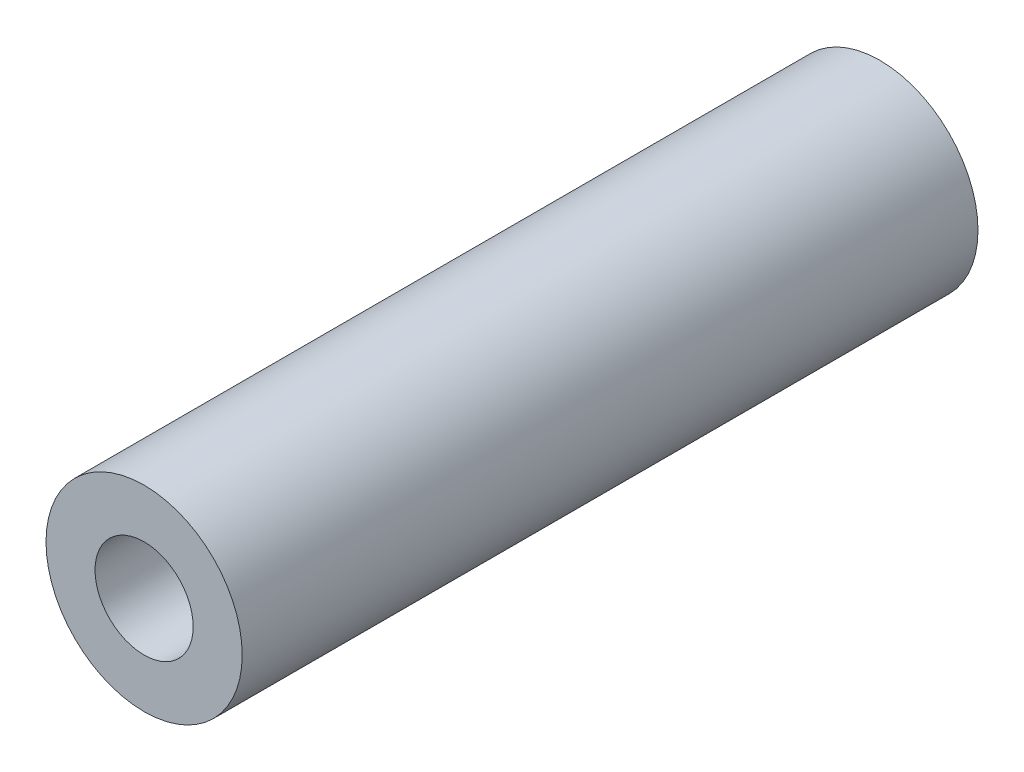
ISO-10303-21;
HEADER;
FILE_DESCRIPTION(('STEP AP214'),'2;1');
FILE_NAME('part.step','',(''),(''),'','','');
FILE_SCHEMA(('AUTOMOTIVE_DESIGN { 1 0 10303 214 1 1 1 1 }'));
ENDSEC;
DATA;
#1=APPLICATION_CONTEXT('core data for automotive mechanical design processes');
#2=APPLICATION_PROTOCOL_DEFINITION('international standard','automotive_design',2000,#1);
#3=PRODUCT_CONTEXT('',#1,'mechanical');
#4=PRODUCT('Part','Part','',(#3));
#5=PRODUCT_RELATED_PRODUCT_CATEGORY('part','',(#4));
#6=PRODUCT_DEFINITION_FORMATION('','',#4);
#7=PRODUCT_DEFINITION_CONTEXT('part definition',#1,'design');
#8=PRODUCT_DEFINITION('design','',#6,#7);
#9=PRODUCT_DEFINITION_SHAPE('','',#8);
#10=(LENGTH_UNIT() NAMED_UNIT(*) SI_UNIT(.MILLI.,.METRE.));
#11=(NAMED_UNIT(*) PLANE_ANGLE_UNIT() SI_UNIT($,.RADIAN.));
#12=(NAMED_UNIT(*) SI_UNIT($,.STERADIAN.) SOLID_ANGLE_UNIT());
#13=UNCERTAINTY_MEASURE_WITH_UNIT(LENGTH_MEASURE(1.E-05),#10,'distance_accuracy_value','');
#14=(GEOMETRIC_REPRESENTATION_CONTEXT(3) GLOBAL_UNCERTAINTY_ASSIGNED_CONTEXT((#13)) GLOBAL_UNIT_ASSIGNED_CONTEXT((#10,
#11,#12)) REPRESENTATION_CONTEXT('',''));
#15=CARTESIAN_POINT('',(0.,0.,0.));
#16=DIRECTION('',(0.,0.,1.));
#17=DIRECTION('',(1.,0.,0.));
#18=AXIS2_PLACEMENT_3D('',#15,#16,#17);
#19=CARTESIAN_POINT('',(0.,0.,30.));
#20=DIRECTION('',(0.,0.,-1.));
#21=DIRECTION('',(-1.,0.,0.));
#22=AXIS2_PLACEMENT_3D('',#19,#20,#21);
#23=CYLINDRICAL_SURFACE('',#22,4.);
#24=CARTESIAN_POINT('',(0.,0.,30.));
#25=DIRECTION('',(0.,0.,1.));
#26=DIRECTION('',(1.,0.,0.));
#27=AXIS2_PLACEMENT_3D('',#24,#25,#26);
#28=CIRCLE('',#27,4.);
#29=CARTESIAN_POINT('',(4.,0.,30.));
#30=VERTEX_POINT('',#29);
#31=EDGE_CURVE('E10',#30,#30,#28,.T.);
#32=ORIENTED_EDGE('',*,*,#31,.F.);
#33=EDGE_LOOP('',(#32));
#34=FACE_BOUND('',#33,.T.);
#35=CARTESIAN_POINT('',(0.,0.,0.));
#36=DIRECTION('',(0.,0.,1.));
#37=DIRECTION('',(1.,0.,0.));
#38=AXIS2_PLACEMENT_3D('',#35,#36,#37);
#39=CIRCLE('',#38,4.);
#40=CARTESIAN_POINT('',(4.,0.,0.));
#41=VERTEX_POINT('',#40);
#42=EDGE_CURVE('E34',#41,#41,#39,.T.);
#43=ORIENTED_EDGE('',*,*,#42,.T.);
#44=EDGE_LOOP('',(#43));
#45=FACE_BOUND('',#44,.T.);
#46=ADVANCED_FACE('F31',(#34,#45),#23,.T.);
#47=CARTESIAN_POINT('',(0.,0.,30.));
#48=DIRECTION('',(0.,0.,1.));
#49=DIRECTION('',(1.,0.,0.));
#50=AXIS2_PLACEMENT_3D('',#47,#48,#49);
#51=PLANE('',#50);
#52=CARTESIAN_POINT('',(0.,0.,30.));
#53=DIRECTION('',(0.,0.,1.));
#54=DIRECTION('',(1.,0.,0.));
#55=AXIS2_PLACEMENT_3D('',#52,#53,#54);
#56=CIRCLE('',#55,2.);
#57=CARTESIAN_POINT('',(2.,0.,30.));
#58=VERTEX_POINT('',#57);
#59=EDGE_CURVE('E43',#58,#58,#56,.T.);
#60=ORIENTED_EDGE('',*,*,#59,.F.);
#61=EDGE_LOOP('',(#60));
#62=FACE_BOUND('',#61,.T.);
#63=ORIENTED_EDGE('',*,*,#31,.T.);
#64=EDGE_LOOP('',(#63));
#65=FACE_BOUND('',#64,.T.);
#66=ADVANCED_FACE('F58',(#62,#65),#51,.T.);
#67=CARTESIAN_POINT('',(0.,0.,0.));
#68=DIRECTION('',(0.,0.,1.));
#69=DIRECTION('',(1.,0.,0.));
#70=AXIS2_PLACEMENT_3D('',#67,#68,#69);
#71=PLANE('',#70);
#72=CARTESIAN_POINT('',(0.,0.,0.));
#73=DIRECTION('',(0.,0.,1.));
#74=DIRECTION('',(1.,0.,0.));
#75=AXIS2_PLACEMENT_3D('',#72,#73,#74);
#76=CIRCLE('',#75,2.);
#77=CARTESIAN_POINT('',(2.,0.,0.));
#78=VERTEX_POINT('',#77);
#79=EDGE_CURVE('E41',#78,#78,#76,.T.);
#80=ORIENTED_EDGE('',*,*,#79,.T.);
#81=EDGE_LOOP('',(#80));
#82=FACE_BOUND('',#81,.T.);
#83=ORIENTED_EDGE('',*,*,#42,.F.);
#84=EDGE_LOOP('',(#83));
#85=FACE_BOUND('',#84,.T.);
#86=ADVANCED_FACE('F49',(#82,#85),#71,.F.);
#87=CARTESIAN_POINT('',(0.,0.,0.));
#88=DIRECTION('',(0.,0.,1.));
#89=DIRECTION('',(1.,0.,0.));
#90=AXIS2_PLACEMENT_3D('',#87,#88,#89);
#91=CYLINDRICAL_SURFACE('',#90,2.);
#92=ORIENTED_EDGE('',*,*,#79,.F.);
#93=EDGE_LOOP('',(#92));
#94=FACE_BOUND('',#93,.T.);
#95=ORIENTED_EDGE('',*,*,#59,.T.);
#96=EDGE_LOOP('',(#95));
#97=FACE_BOUND('',#96,.T.);
#98=ADVANCED_FACE('F52',(#94,#97),#91,.F.);
#99=CLOSED_SHELL('',(#46,#66,#86,#98));
#100=MANIFOLD_SOLID_BREP('B2',#99);
#101=ADVANCED_BREP_SHAPE_REPRESENTATION('',(#18,#100),#14);
#102=SHAPE_DEFINITION_REPRESENTATION(#9,#101);
ENDSEC;
END-ISO-10303-21;
